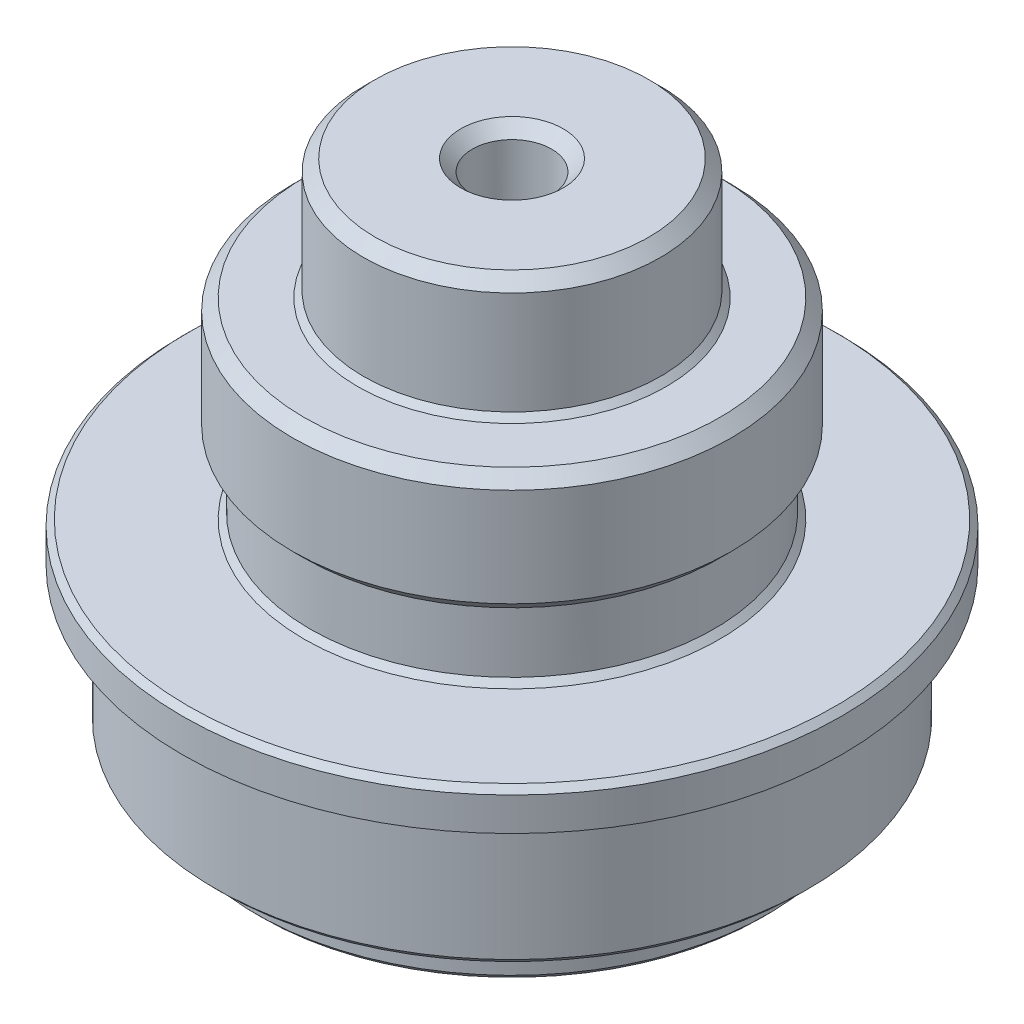
ISO-10303-21;
HEADER;
FILE_DESCRIPTION(('STEP AP214'),'2;1');
FILE_NAME('part.step','',(''),(''),'','','');
FILE_SCHEMA(('AUTOMOTIVE_DESIGN { 1 0 10303 214 1 1 1 1 }'));
ENDSEC;
DATA;
#1=APPLICATION_CONTEXT('core data for automotive mechanical design processes');
#2=APPLICATION_PROTOCOL_DEFINITION('international standard','automotive_design',2000,#1);
#3=PRODUCT_CONTEXT('',#1,'mechanical');
#4=PRODUCT('Part','Part','',(#3));
#5=PRODUCT_RELATED_PRODUCT_CATEGORY('part','',(#4));
#6=PRODUCT_DEFINITION_FORMATION('','',#4);
#7=PRODUCT_DEFINITION_CONTEXT('part definition',#1,'design');
#8=PRODUCT_DEFINITION('design','',#6,#7);
#9=PRODUCT_DEFINITION_SHAPE('','',#8);
#10=(LENGTH_UNIT() NAMED_UNIT(*) SI_UNIT(.MILLI.,.METRE.));
#11=(NAMED_UNIT(*) PLANE_ANGLE_UNIT() SI_UNIT($,.RADIAN.));
#12=(NAMED_UNIT(*) SI_UNIT($,.STERADIAN.) SOLID_ANGLE_UNIT());
#13=UNCERTAINTY_MEASURE_WITH_UNIT(LENGTH_MEASURE(1.E-05),#10,'distance_accuracy_value','');
#14=(GEOMETRIC_REPRESENTATION_CONTEXT(3) GLOBAL_UNCERTAINTY_ASSIGNED_CONTEXT((#13)) GLOBAL_UNIT_ASSIGNED_CONTEXT((#10,
#11,#12)) REPRESENTATION_CONTEXT('',''));
#15=CARTESIAN_POINT('',(0.,0.,0.));
#16=DIRECTION('',(0.,0.,1.));
#17=DIRECTION('',(1.,0.,0.));
#18=AXIS2_PLACEMENT_3D('',#15,#16,#17);
#19=CARTESIAN_POINT('',(0.,0.,0.));
#20=DIRECTION('',(0.,-1.,0.));
#21=DIRECTION('',(0.,0.,-1.));
#22=AXIS2_PLACEMENT_3D('',#19,#20,#21);
#23=CYLINDRICAL_SURFACE('',#22,3.38);
#24=CARTESIAN_POINT('',(0.,44.5,0.));
#25=DIRECTION('',(0.,1.,0.));
#26=DIRECTION('',(0.,0.,1.));
#27=AXIS2_PLACEMENT_3D('',#24,#25,#26);
#28=CIRCLE('',#27,3.38);
#29=CARTESIAN_POINT('',(0.,44.5,3.38));
#30=VERTEX_POINT('',#29);
#31=EDGE_CURVE('E106',#30,#30,#28,.T.);
#32=ORIENTED_EDGE('',*,*,#31,.T.);
#33=EDGE_LOOP('',(#32));
#34=FACE_BOUND('',#33,.T.);
#35=CARTESIAN_POINT('',(0.,28.,0.));
#36=DIRECTION('',(0.,-1.,0.));
#37=DIRECTION('',(0.,0.,-1.));
#38=AXIS2_PLACEMENT_3D('',#35,#36,#37);
#39=CIRCLE('',#38,3.38);
#40=CARTESIAN_POINT('',(0.,28.,-3.38));
#41=VERTEX_POINT('',#40);
#42=EDGE_CURVE('E130',#41,#41,#39,.T.);
#43=ORIENTED_EDGE('',*,*,#42,.T.);
#44=EDGE_LOOP('',(#43));
#45=FACE_BOUND('',#44,.T.);
#46=ADVANCED_FACE('F41',(#34,#45),#23,.F.);
#47=CARTESIAN_POINT('',(0.,28.,0.));
#48=DIRECTION('',(0.,1.,0.));
#49=DIRECTION('',(0.,0.,1.));
#50=AXIS2_PLACEMENT_3D('',#47,#48,#49);
#51=PLANE('',#50);
#52=ORIENTED_EDGE('',*,*,#42,.F.);
#53=EDGE_LOOP('',(#52));
#54=FACE_BOUND('',#53,.T.);
#55=ADVANCED_FACE('F173',(#54),#51,.T.);
#56=CARTESIAN_POINT('',(0.,26.6296481043478,0.));
#57=DIRECTION('',(0.,1.,0.));
#58=DIRECTION('',(0.,0.,1.));
#59=AXIS2_PLACEMENT_3D('',#56,#57,#58);
#60=PLANE('',#59);
#61=CARTESIAN_POINT('',(0.,26.6296481043478,0.));
#62=DIRECTION('',(0.,-1.,0.));
#63=DIRECTION('',(0.,0.,-1.));
#64=AXIS2_PLACEMENT_3D('',#61,#62,#63);
#65=CIRCLE('',#64,14.5286409017713);
#66=CARTESIAN_POINT('',(0.,26.6296481043478,-14.5286409017713));
#67=VERTEX_POINT('',#66);
#68=EDGE_CURVE('E134',#67,#67,#65,.T.);
#69=ORIENTED_EDGE('',*,*,#68,.T.);
#70=EDGE_LOOP('',(#69));
#71=FACE_BOUND('',#70,.T.);
#72=ADVANCED_FACE('F179',(#71),#60,.F.);
#73=CARTESIAN_POINT('',(0.,0.,0.));
#74=DIRECTION('',(0.,-1.,0.));
#75=DIRECTION('',(0.,0.,-1.));
#76=AXIS2_PLACEMENT_3D('',#73,#74,#75);
#77=CYLINDRICAL_SURFACE('',#76,14.5286409017713);
#78=CARTESIAN_POINT('',(0.,0.500000000000009,0.));
#79=DIRECTION('',(0.,-1.,0.));
#80=DIRECTION('',(0.,0.,-1.));
#81=AXIS2_PLACEMENT_3D('',#78,#79,#80);
#82=CIRCLE('',#81,14.5286409017713);
#83=CARTESIAN_POINT('',(0.,0.500000000000009,-14.5286409017713));
#84=VERTEX_POINT('',#83);
#85=EDGE_CURVE('E94',#84,#84,#82,.T.);
#86=ORIENTED_EDGE('',*,*,#85,.T.);
#87=EDGE_LOOP('',(#86));
#88=FACE_BOUND('',#87,.T.);
#89=ORIENTED_EDGE('',*,*,#68,.F.);
#90=EDGE_LOOP('',(#89));
#91=FACE_BOUND('',#90,.T.);
#92=ADVANCED_FACE('F268',(#88,#91),#77,.F.);
#93=CARTESIAN_POINT('',(0.,0.,0.));
#94=DIRECTION('',(0.,-1.,0.));
#95=DIRECTION('',(0.,0.,-1.));
#96=AXIS2_PLACEMENT_3D('',#93,#94,#95);
#97=PLANE('',#96);
#98=CARTESIAN_POINT('',(0.,0.,0.));
#99=DIRECTION('',(0.,-1.,0.));
#100=DIRECTION('',(0.,0.,-1.));
#101=AXIS2_PLACEMENT_3D('',#98,#99,#100);
#102=CIRCLE('',#101,15.0286409017713);
#103=CARTESIAN_POINT('',(0.,0.,-15.0286409017713));
#104=VERTEX_POINT('',#103);
#105=EDGE_CURVE('E86',#104,#104,#102,.F.);
#106=ORIENTED_EDGE('',*,*,#105,.T.);
#107=EDGE_LOOP('',(#106));
#108=FACE_BOUND('',#107,.T.);
#109=CARTESIAN_POINT('',(0.,0.,0.));
#110=DIRECTION('',(0.,-1.,0.));
#111=DIRECTION('',(0.,0.,-1.));
#112=AXIS2_PLACEMENT_3D('',#109,#110,#111);
#113=CIRCLE('',#112,21.3386409017713);
#114=CARTESIAN_POINT('',(0.,0.,-21.3386409017713));
#115=VERTEX_POINT('',#114);
#116=EDGE_CURVE('E90',#115,#115,#113,.T.);
#117=ORIENTED_EDGE('',*,*,#116,.T.);
#118=EDGE_LOOP('',(#117));
#119=FACE_BOUND('',#118,.T.);
#120=ADVANCED_FACE('F263',(#108,#119),#97,.T.);
#121=CARTESIAN_POINT('',(0.,0.,0.));
#122=DIRECTION('',(0.,-1.,0.));
#123=DIRECTION('',(0.,0.,-1.));
#124=AXIS2_PLACEMENT_3D('',#121,#122,#123);
#125=CYLINDRICAL_SURFACE('',#124,21.8386409017713);
#126=CARTESIAN_POINT('',(0.,0.499999999999994,0.));
#127=DIRECTION('',(0.,-1.,0.));
#128=DIRECTION('',(0.,0.,-1.));
#129=AXIS2_PLACEMENT_3D('',#126,#127,#128);
#130=CIRCLE('',#129,21.8386409017713);
#131=CARTESIAN_POINT('',(0.,0.499999999999994,-21.8386409017713));
#132=VERTEX_POINT('',#131);
#133=EDGE_CURVE('E10',#132,#132,#130,.F.);
#134=ORIENTED_EDGE('',*,*,#133,.T.);
#135=EDGE_LOOP('',(#134));
#136=FACE_BOUND('',#135,.T.);
#137=CARTESIAN_POINT('',(0.,3.65,0.));
#138=DIRECTION('',(0.,-1.,0.));
#139=DIRECTION('',(0.,0.,-1.));
#140=AXIS2_PLACEMENT_3D('',#137,#138,#139);
#141=CIRCLE('',#140,21.8386409017713);
#142=CARTESIAN_POINT('',(0.,3.65,-21.8386409017713));
#143=VERTEX_POINT('',#142);
#144=EDGE_CURVE('E138',#143,#143,#141,.T.);
#145=ORIENTED_EDGE('',*,*,#144,.T.);
#146=EDGE_LOOP('',(#145));
#147=FACE_BOUND('',#146,.T.);
#148=ADVANCED_FACE('F258',(#136,#147),#125,.T.);
#149=CARTESIAN_POINT('',(0.,3.65,0.));
#150=DIRECTION('',(0.,-1.,0.));
#151=DIRECTION('',(0.,0.,-1.));
#152=AXIS2_PLACEMENT_3D('',#149,#150,#151);
#153=PLANE('',#152);
#154=CARTESIAN_POINT('',(0.,3.65,0.));
#155=DIRECTION('',(0.,-1.,0.));
#156=DIRECTION('',(0.,0.,-1.));
#157=AXIS2_PLACEMENT_3D('',#154,#155,#156);
#158=CIRCLE('',#157,24.85);
#159=CARTESIAN_POINT('',(0.,3.65,-24.85));
#160=VERTEX_POINT('',#159);
#161=EDGE_CURVE('E55',#160,#160,#158,.T.);
#162=ORIENTED_EDGE('',*,*,#161,.T.);
#163=EDGE_LOOP('',(#162));
#164=FACE_BOUND('',#163,.T.);
#165=ORIENTED_EDGE('',*,*,#144,.F.);
#166=EDGE_LOOP('',(#165));
#167=FACE_BOUND('',#166,.T.);
#168=ADVANCED_FACE('F254',(#164,#167),#153,.T.);
#169=CARTESIAN_POINT('',(0.,0.,0.));
#170=DIRECTION('',(0.,-1.,0.));
#171=DIRECTION('',(0.,0.,-1.));
#172=AXIS2_PLACEMENT_3D('',#169,#170,#171);
#173=CYLINDRICAL_SURFACE('',#172,25.35);
#174=CARTESIAN_POINT('',(0.,4.15000000000001,0.));
#175=DIRECTION('',(0.,-1.,0.));
#176=DIRECTION('',(0.,0.,-1.));
#177=AXIS2_PLACEMENT_3D('',#174,#175,#176);
#178=CIRCLE('',#177,25.35);
#179=CARTESIAN_POINT('',(0.,4.15000000000001,-25.35));
#180=VERTEX_POINT('',#179);
#181=EDGE_CURVE('E50',#180,#180,#178,.F.);
#182=ORIENTED_EDGE('',*,*,#181,.T.);
#183=EDGE_LOOP('',(#182));
#184=FACE_BOUND('',#183,.T.);
#185=CARTESIAN_POINT('',(0.,15.45,0.));
#186=DIRECTION('',(0.,-1.,0.));
#187=DIRECTION('',(0.,0.,-1.));
#188=AXIS2_PLACEMENT_3D('',#185,#186,#187);
#189=CIRCLE('',#188,25.35);
#190=CARTESIAN_POINT('',(0.,15.45,-25.35));
#191=VERTEX_POINT('',#190);
#192=EDGE_CURVE('E142',#191,#191,#189,.T.);
#193=ORIENTED_EDGE('',*,*,#192,.T.);
#194=EDGE_LOOP('',(#193));
#195=FACE_BOUND('',#194,.T.);
#196=ADVANCED_FACE('F257',(#184,#195),#173,.T.);
#197=CARTESIAN_POINT('',(0.,15.45,0.));
#198=DIRECTION('',(0.,-1.,0.));
#199=DIRECTION('',(0.,0.,-1.));
#200=AXIS2_PLACEMENT_3D('',#197,#198,#199);
#201=PLANE('',#200);
#202=CARTESIAN_POINT('',(0.,15.45,0.));
#203=DIRECTION('',(0.,-1.,0.));
#204=DIRECTION('',(0.,0.,-1.));
#205=AXIS2_PLACEMENT_3D('',#202,#203,#204);
#206=CIRCLE('',#205,28.1474074074074);
#207=CARTESIAN_POINT('',(0.,15.45,-28.1474074074074));
#208=VERTEX_POINT('',#207);
#209=EDGE_CURVE('E146',#208,#208,#206,.T.);
#210=ORIENTED_EDGE('',*,*,#209,.T.);
#211=EDGE_LOOP('',(#210));
#212=FACE_BOUND('',#211,.T.);
#213=ORIENTED_EDGE('',*,*,#192,.F.);
#214=EDGE_LOOP('',(#213));
#215=FACE_BOUND('',#214,.T.);
#216=ADVANCED_FACE('F312',(#212,#215),#201,.T.);
#217=CARTESIAN_POINT('',(0.,0.,0.));
#218=DIRECTION('',(0.,-1.,0.));
#219=DIRECTION('',(0.,0.,-1.));
#220=AXIS2_PLACEMENT_3D('',#217,#218,#219);
#221=CYLINDRICAL_SURFACE('',#220,28.1474074074074);
#222=CARTESIAN_POINT('',(0.,18.3,0.));
#223=DIRECTION('',(0.,1.,0.));
#224=DIRECTION('',(0.,0.,1.));
#225=AXIS2_PLACEMENT_3D('',#222,#223,#224);
#226=CIRCLE('',#225,28.1474074074074);
#227=CARTESIAN_POINT('',(0.,18.3,28.1474074074074));
#228=VERTEX_POINT('',#227);
#229=EDGE_CURVE('E60',#228,#228,#226,.F.);
#230=ORIENTED_EDGE('',*,*,#229,.T.);
#231=EDGE_LOOP('',(#230));
#232=FACE_BOUND('',#231,.T.);
#233=ORIENTED_EDGE('',*,*,#209,.F.);
#234=EDGE_LOOP('',(#233));
#235=FACE_BOUND('',#234,.T.);
#236=ADVANCED_FACE('F318',(#232,#235),#221,.T.);
#237=CARTESIAN_POINT('',(0.,18.8,0.));
#238=DIRECTION('',(0.,1.,0.));
#239=DIRECTION('',(0.,0.,1.));
#240=AXIS2_PLACEMENT_3D('',#237,#238,#239);
#241=PLANE('',#240);
#242=CARTESIAN_POINT('',(0.,18.8,0.));
#243=DIRECTION('',(0.,1.,0.));
#244=DIRECTION('',(0.,0.,1.));
#245=AXIS2_PLACEMENT_3D('',#242,#243,#244);
#246=CIRCLE('',#245,17.75);
#247=CARTESIAN_POINT('',(0.,18.8,17.75));
#248=VERTEX_POINT('',#247);
#249=EDGE_CURVE('E70',#248,#248,#246,.F.);
#250=ORIENTED_EDGE('',*,*,#249,.T.);
#251=EDGE_LOOP('',(#250));
#252=FACE_BOUND('',#251,.T.);
#253=CARTESIAN_POINT('',(0.,18.8,0.));
#254=DIRECTION('',(0.,1.,0.));
#255=DIRECTION('',(0.,0.,1.));
#256=AXIS2_PLACEMENT_3D('',#253,#254,#255);
#257=CIRCLE('',#256,27.6474074074074);
#258=CARTESIAN_POINT('',(0.,18.8,27.6474074074074));
#259=VERTEX_POINT('',#258);
#260=EDGE_CURVE('E74',#259,#259,#257,.T.);
#261=ORIENTED_EDGE('',*,*,#260,.T.);
#262=EDGE_LOOP('',(#261));
#263=FACE_BOUND('',#262,.T.);
#264=ADVANCED_FACE('F169',(#252,#263),#241,.T.);
#265=CARTESIAN_POINT('',(0.,0.,0.));
#266=DIRECTION('',(0.,-1.,0.));
#267=DIRECTION('',(0.,0.,-1.));
#268=AXIS2_PLACEMENT_3D('',#265,#266,#267);
#269=CYLINDRICAL_SURFACE('',#268,17.25);
#270=CARTESIAN_POINT('',(0.,19.3,0.));
#271=DIRECTION('',(0.,1.,0.));
#272=DIRECTION('',(0.,0.,1.));
#273=AXIS2_PLACEMENT_3D('',#270,#271,#272);
#274=CIRCLE('',#273,17.25);
#275=CARTESIAN_POINT('',(0.,19.3,17.25));
#276=VERTEX_POINT('',#275);
#277=EDGE_CURVE('E66',#276,#276,#274,.T.);
#278=ORIENTED_EDGE('',*,*,#277,.T.);
#279=EDGE_LOOP('',(#278));
#280=FACE_BOUND('',#279,.T.);
#281=CARTESIAN_POINT('',(0.,24.8,0.));
#282=DIRECTION('',(0.,-1.,0.));
#283=DIRECTION('',(0.,0.,-1.));
#284=AXIS2_PLACEMENT_3D('',#281,#282,#283);
#285=CIRCLE('',#284,17.25);
#286=CARTESIAN_POINT('',(0.,24.8,-17.25));
#287=VERTEX_POINT('',#286);
#288=EDGE_CURVE('E150',#287,#287,#285,.T.);
#289=ORIENTED_EDGE('',*,*,#288,.T.);
#290=EDGE_LOOP('',(#289));
#291=FACE_BOUND('',#290,.T.);
#292=ADVANCED_FACE('F155',(#280,#291),#269,.T.);
#293=CARTESIAN_POINT('',(1.14723045877933E-13,24.8,0.));
#294=DIRECTION('',(0.,-1.,0.));
#295=DIRECTION('',(0.,0.,-1.));
#296=AXIS2_PLACEMENT_3D('',#293,#294,#295);
#297=PLANE('',#296);
#298=CARTESIAN_POINT('',(0.,24.8,0.));
#299=DIRECTION('',(0.,-1.,0.));
#300=DIRECTION('',(0.,0.,-1.));
#301=AXIS2_PLACEMENT_3D('',#298,#299,#300);
#302=CIRCLE('',#301,17.75);
#303=CARTESIAN_POINT('',(0.,24.8,-17.75));
#304=VERTEX_POINT('',#303);
#305=EDGE_CURVE('E126',#304,#304,#302,.T.);
#306=ORIENTED_EDGE('',*,*,#305,.T.);
#307=EDGE_LOOP('',(#306));
#308=FACE_BOUND('',#307,.T.);
#309=ORIENTED_EDGE('',*,*,#288,.F.);
#310=EDGE_LOOP('',(#309));
#311=FACE_BOUND('',#310,.T.);
#312=ADVANCED_FACE('F157',(#308,#311),#297,.T.);
#313=CARTESIAN_POINT('',(0.,0.,0.));
#314=DIRECTION('',(0.,-1.,0.));
#315=DIRECTION('',(0.,0.,-1.));
#316=AXIS2_PLACEMENT_3D('',#313,#314,#315);
#317=CYLINDRICAL_SURFACE('',#316,18.75);
#318=CARTESIAN_POINT('',(0.,25.8,0.));
#319=DIRECTION('',(0.,-1.,0.));
#320=DIRECTION('',(0.,0.,-1.));
#321=AXIS2_PLACEMENT_3D('',#318,#319,#320);
#322=CIRCLE('',#321,18.75);
#323=CARTESIAN_POINT('',(0.,25.8,-18.75));
#324=VERTEX_POINT('',#323);
#325=EDGE_CURVE('E118',#324,#324,#322,.F.);
#326=ORIENTED_EDGE('',*,*,#325,.T.);
#327=EDGE_LOOP('',(#326));
#328=FACE_BOUND('',#327,.T.);
#329=CARTESIAN_POINT('',(0.,34.2,0.));
#330=DIRECTION('',(0.,1.,0.));
#331=DIRECTION('',(0.,0.,1.));
#332=AXIS2_PLACEMENT_3D('',#329,#330,#331);
#333=CIRCLE('',#332,18.75);
#334=CARTESIAN_POINT('',(0.,34.2,18.75));
#335=VERTEX_POINT('',#334);
#336=EDGE_CURVE('E122',#335,#335,#333,.F.);
#337=ORIENTED_EDGE('',*,*,#336,.T.);
#338=EDGE_LOOP('',(#337));
#339=FACE_BOUND('',#338,.T.);
#340=ADVANCED_FACE('F159',(#328,#339),#317,.T.);
#341=CARTESIAN_POINT('',(0.,35.2,0.));
#342=DIRECTION('',(0.,1.,0.));
#343=DIRECTION('',(0.,0.,1.));
#344=AXIS2_PLACEMENT_3D('',#341,#342,#343);
#345=PLANE('',#344);
#346=CARTESIAN_POINT('',(0.,35.2,0.));
#347=DIRECTION('',(0.,1.,0.));
#348=DIRECTION('',(0.,0.,1.));
#349=AXIS2_PLACEMENT_3D('',#346,#347,#348);
#350=CIRCLE('',#349,13.18);
#351=CARTESIAN_POINT('',(0.,35.2,13.18));
#352=VERTEX_POINT('',#351);
#353=EDGE_CURVE('E82',#352,#352,#350,.F.);
#354=ORIENTED_EDGE('',*,*,#353,.T.);
#355=EDGE_LOOP('',(#354));
#356=FACE_BOUND('',#355,.T.);
#357=CARTESIAN_POINT('',(0.,35.2,0.));
#358=DIRECTION('',(0.,1.,0.));
#359=DIRECTION('',(0.,0.,1.));
#360=AXIS2_PLACEMENT_3D('',#357,#358,#359);
#361=CIRCLE('',#360,17.75);
#362=CARTESIAN_POINT('',(0.,35.2,17.75));
#363=VERTEX_POINT('',#362);
#364=EDGE_CURVE('E114',#363,#363,#361,.T.);
#365=ORIENTED_EDGE('',*,*,#364,.T.);
#366=EDGE_LOOP('',(#365));
#367=FACE_BOUND('',#366,.T.);
#368=ADVANCED_FACE('F166',(#356,#367),#345,.T.);
#369=CARTESIAN_POINT('',(0.,0.,0.));
#370=DIRECTION('',(0.,-1.,0.));
#371=DIRECTION('',(0.,0.,-1.));
#372=AXIS2_PLACEMENT_3D('',#369,#370,#371);
#373=CYLINDRICAL_SURFACE('',#372,12.68);
#374=CARTESIAN_POINT('',(0.,35.7,0.));
#375=DIRECTION('',(0.,1.,0.));
#376=DIRECTION('',(0.,0.,1.));
#377=AXIS2_PLACEMENT_3D('',#374,#375,#376);
#378=CIRCLE('',#377,12.68);
#379=CARTESIAN_POINT('',(0.,35.7,12.68));
#380=VERTEX_POINT('',#379);
#381=EDGE_CURVE('E78',#380,#380,#378,.T.);
#382=ORIENTED_EDGE('',*,*,#381,.T.);
#383=EDGE_LOOP('',(#382));
#384=FACE_BOUND('',#383,.T.);
#385=CARTESIAN_POINT('',(0.,44.5,0.));
#386=DIRECTION('',(0.,1.,0.));
#387=DIRECTION('',(0.,0.,1.));
#388=AXIS2_PLACEMENT_3D('',#385,#386,#387);
#389=CIRCLE('',#388,12.68);
#390=CARTESIAN_POINT('',(0.,44.5,12.68));
#391=VERTEX_POINT('',#390);
#392=EDGE_CURVE('E102',#391,#391,#389,.F.);
#393=ORIENTED_EDGE('',*,*,#392,.T.);
#394=EDGE_LOOP('',(#393));
#395=FACE_BOUND('',#394,.T.);
#396=ADVANCED_FACE('F348',(#384,#395),#373,.T.);
#397=CARTESIAN_POINT('',(0.,45.5,0.));
#398=DIRECTION('',(0.,1.,0.));
#399=DIRECTION('',(0.,0.,1.));
#400=AXIS2_PLACEMENT_3D('',#397,#398,#399);
#401=PLANE('',#400);
#402=CARTESIAN_POINT('',(0.,45.5,0.));
#403=DIRECTION('',(0.,1.,0.));
#404=DIRECTION('',(0.,0.,1.));
#405=AXIS2_PLACEMENT_3D('',#402,#403,#404);
#406=CIRCLE('',#405,11.68);
#407=CARTESIAN_POINT('',(0.,45.5,11.68));
#408=VERTEX_POINT('',#407);
#409=EDGE_CURVE('E98',#408,#408,#406,.T.);
#410=ORIENTED_EDGE('',*,*,#409,.T.);
#411=EDGE_LOOP('',(#410));
#412=FACE_BOUND('',#411,.T.);
#413=CARTESIAN_POINT('',(0.,45.5,0.));
#414=DIRECTION('',(0.,1.,0.));
#415=DIRECTION('',(0.,0.,1.));
#416=AXIS2_PLACEMENT_3D('',#413,#414,#415);
#417=CIRCLE('',#416,4.38);
#418=CARTESIAN_POINT('',(0.,45.5,4.38));
#419=VERTEX_POINT('',#418);
#420=EDGE_CURVE('E110',#419,#419,#417,.F.);
#421=ORIENTED_EDGE('',*,*,#420,.T.);
#422=EDGE_LOOP('',(#421));
#423=FACE_BOUND('',#422,.T.);
#424=ADVANCED_FACE('F193',(#412,#423),#401,.T.);
#425=CARTESIAN_POINT('',(0.,24.8,0.));
#426=DIRECTION('',(0.,1.,0.));
#427=DIRECTION('',(0.,0.,1.));
#428=AXIS2_PLACEMENT_3D('',#425,#426,#427);
#429=CONICAL_SURFACE('',#428,17.75,0.785398163397443);
#430=ORIENTED_EDGE('',*,*,#325,.F.);
#431=EDGE_LOOP('',(#430));
#432=FACE_BOUND('',#431,.T.);
#433=ORIENTED_EDGE('',*,*,#305,.F.);
#434=EDGE_LOOP('',(#433));
#435=FACE_BOUND('',#434,.T.);
#436=ADVANCED_FACE('F186',(#432,#435),#429,.T.);
#437=CARTESIAN_POINT('',(0.,34.2,0.));
#438=DIRECTION('',(0.,-1.,0.));
#439=DIRECTION('',(0.,0.,-1.));
#440=AXIS2_PLACEMENT_3D('',#437,#438,#439);
#441=CONICAL_SURFACE('',#440,18.75,0.785398163397448);
#442=ORIENTED_EDGE('',*,*,#364,.F.);
#443=EDGE_LOOP('',(#442));
#444=FACE_BOUND('',#443,.T.);
#445=ORIENTED_EDGE('',*,*,#336,.F.);
#446=EDGE_LOOP('',(#445));
#447=FACE_BOUND('',#446,.T.);
#448=ADVANCED_FACE('F192',(#444,#447),#441,.T.);
#449=CARTESIAN_POINT('',(0.,45.5,0.));
#450=DIRECTION('',(0.,1.,0.));
#451=DIRECTION('',(0.,0.,1.));
#452=AXIS2_PLACEMENT_3D('',#449,#450,#451);
#453=CONICAL_SURFACE('',#452,4.38,0.785398163397452);
#454=ORIENTED_EDGE('',*,*,#31,.F.);
#455=EDGE_LOOP('',(#454));
#456=FACE_BOUND('',#455,.T.);
#457=ORIENTED_EDGE('',*,*,#420,.F.);
#458=EDGE_LOOP('',(#457));
#459=FACE_BOUND('',#458,.T.);
#460=ADVANCED_FACE('F200',(#456,#459),#453,.F.);
#461=CARTESIAN_POINT('',(0.,44.5,0.));
#462=DIRECTION('',(0.,-1.,0.));
#463=DIRECTION('',(0.,0.,-1.));
#464=AXIS2_PLACEMENT_3D('',#461,#462,#463);
#465=CONICAL_SURFACE('',#464,12.68,0.785398163397447);
#466=ORIENTED_EDGE('',*,*,#409,.F.);
#467=EDGE_LOOP('',(#466));
#468=FACE_BOUND('',#467,.T.);
#469=ORIENTED_EDGE('',*,*,#392,.F.);
#470=EDGE_LOOP('',(#469));
#471=FACE_BOUND('',#470,.T.);
#472=ADVANCED_FACE('F207',(#468,#471),#465,.T.);
#473=CARTESIAN_POINT('',(0.,0.500000000000009,0.));
#474=DIRECTION('',(0.,-1.,0.));
#475=DIRECTION('',(0.,0.,-1.));
#476=AXIS2_PLACEMENT_3D('',#473,#474,#475);
#477=CONICAL_SURFACE('',#476,14.5286409017713,0.785398163397454);
#478=ORIENTED_EDGE('',*,*,#105,.F.);
#479=EDGE_LOOP('',(#478));
#480=FACE_BOUND('',#479,.T.);
#481=ORIENTED_EDGE('',*,*,#85,.F.);
#482=EDGE_LOOP('',(#481));
#483=FACE_BOUND('',#482,.T.);
#484=ADVANCED_FACE('F214',(#480,#483),#477,.F.);
#485=CARTESIAN_POINT('',(0.,35.2,0.));
#486=DIRECTION('',(0.,-1.,0.));
#487=DIRECTION('',(0.,0.,-1.));
#488=AXIS2_PLACEMENT_3D('',#485,#486,#487);
#489=CONICAL_SURFACE('',#488,13.18,0.785398163397445);
#490=ORIENTED_EDGE('',*,*,#381,.F.);
#491=EDGE_LOOP('',(#490));
#492=FACE_BOUND('',#491,.T.);
#493=ORIENTED_EDGE('',*,*,#353,.F.);
#494=EDGE_LOOP('',(#493));
#495=FACE_BOUND('',#494,.T.);
#496=ADVANCED_FACE('F221',(#492,#495),#489,.T.);
#497=CARTESIAN_POINT('',(0.,18.8,0.));
#498=DIRECTION('',(0.,-1.,0.));
#499=DIRECTION('',(0.,0.,-1.));
#500=AXIS2_PLACEMENT_3D('',#497,#498,#499);
#501=CONICAL_SURFACE('',#500,17.75,0.785398163397455);
#502=ORIENTED_EDGE('',*,*,#277,.F.);
#503=EDGE_LOOP('',(#502));
#504=FACE_BOUND('',#503,.T.);
#505=ORIENTED_EDGE('',*,*,#249,.F.);
#506=EDGE_LOOP('',(#505));
#507=FACE_BOUND('',#506,.T.);
#508=ADVANCED_FACE('F228',(#504,#507),#501,.T.);
#509=CARTESIAN_POINT('',(0.,18.3,0.));
#510=DIRECTION('',(0.,-1.,0.));
#511=DIRECTION('',(0.,0.,-1.));
#512=AXIS2_PLACEMENT_3D('',#509,#510,#511);
#513=CONICAL_SURFACE('',#512,28.1474074074074,0.785398163397452);
#514=ORIENTED_EDGE('',*,*,#260,.F.);
#515=EDGE_LOOP('',(#514));
#516=FACE_BOUND('',#515,.T.);
#517=ORIENTED_EDGE('',*,*,#229,.F.);
#518=EDGE_LOOP('',(#517));
#519=FACE_BOUND('',#518,.T.);
#520=ADVANCED_FACE('F235',(#516,#519),#513,.T.);
#521=CARTESIAN_POINT('',(0.,3.65,0.));
#522=DIRECTION('',(0.,1.,0.));
#523=DIRECTION('',(0.,0.,1.));
#524=AXIS2_PLACEMENT_3D('',#521,#522,#523);
#525=CONICAL_SURFACE('',#524,24.85,0.785398163397431);
#526=ORIENTED_EDGE('',*,*,#181,.F.);
#527=EDGE_LOOP('',(#526));
#528=FACE_BOUND('',#527,.T.);
#529=ORIENTED_EDGE('',*,*,#161,.F.);
#530=EDGE_LOOP('',(#529));
#531=FACE_BOUND('',#530,.T.);
#532=ADVANCED_FACE('F241',(#528,#531),#525,.T.);
#533=CARTESIAN_POINT('',(0.,0.,0.));
#534=DIRECTION('',(0.,1.,0.));
#535=DIRECTION('',(0.,0.,1.));
#536=AXIS2_PLACEMENT_3D('',#533,#534,#535);
#537=CONICAL_SURFACE('',#536,21.3386409017713,0.785398163397445);
#538=ORIENTED_EDGE('',*,*,#133,.F.);
#539=EDGE_LOOP('',(#538));
#540=FACE_BOUND('',#539,.T.);
#541=ORIENTED_EDGE('',*,*,#116,.F.);
#542=EDGE_LOOP('',(#541));
#543=FACE_BOUND('',#542,.T.);
#544=ADVANCED_FACE('F44',(#540,#543),#537,.T.);
#545=CLOSED_SHELL('',(#46,#55,#72,#92,#120,#148,#168,#196,#216,#236,#264,#292,#312,#340,#368,
#396,#424,#436,#448,#460,#472,#484,#496,#508,#520,#532,#544));
#546=MANIFOLD_SOLID_BREP('B2',#545);
#547=ADVANCED_BREP_SHAPE_REPRESENTATION('',(#18,#546),#14);
#548=SHAPE_DEFINITION_REPRESENTATION(#9,#547);
ENDSEC;
END-ISO-10303-21;
